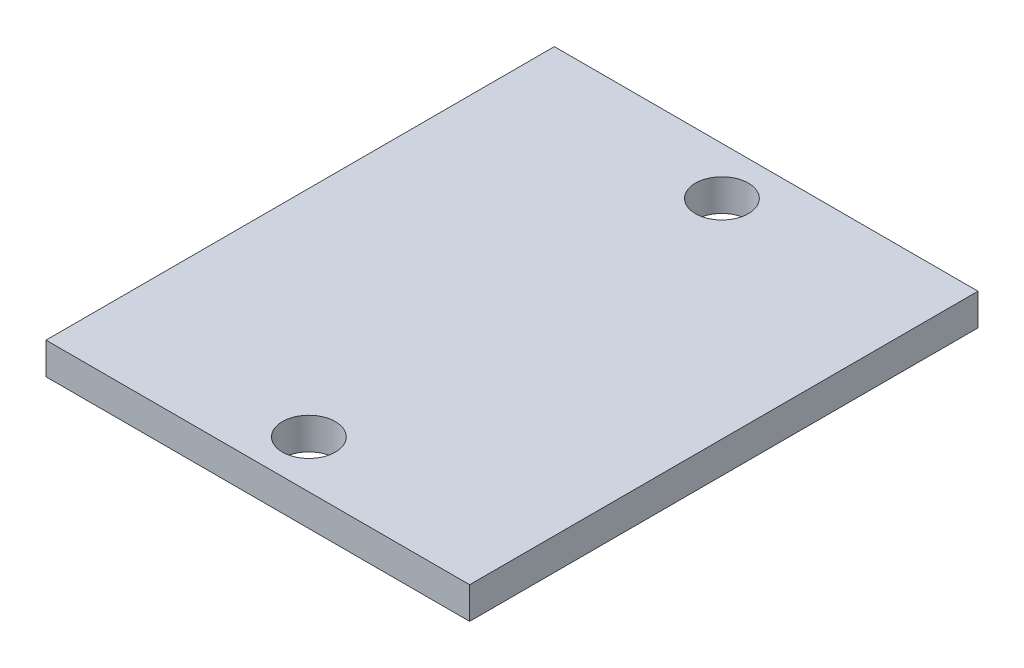
ISO-10303-21;
HEADER;
FILE_DESCRIPTION(('STEP AP214'),'2;1');
FILE_NAME('part.step','',(''),(''),'','','');
FILE_SCHEMA(('AUTOMOTIVE_DESIGN { 1 0 10303 214 1 1 1 1 }'));
ENDSEC;
DATA;
#1=APPLICATION_CONTEXT('core data for automotive mechanical design processes');
#2=APPLICATION_PROTOCOL_DEFINITION('international standard','automotive_design',2000,#1);
#3=PRODUCT_CONTEXT('',#1,'mechanical');
#4=PRODUCT('Part','Part','',(#3));
#5=PRODUCT_RELATED_PRODUCT_CATEGORY('part','',(#4));
#6=PRODUCT_DEFINITION_FORMATION('','',#4);
#7=PRODUCT_DEFINITION_CONTEXT('part definition',#1,'design');
#8=PRODUCT_DEFINITION('design','',#6,#7);
#9=PRODUCT_DEFINITION_SHAPE('','',#8);
#10=(LENGTH_UNIT() NAMED_UNIT(*) SI_UNIT(.MILLI.,.METRE.));
#11=(NAMED_UNIT(*) PLANE_ANGLE_UNIT() SI_UNIT($,.RADIAN.));
#12=(NAMED_UNIT(*) SI_UNIT($,.STERADIAN.) SOLID_ANGLE_UNIT());
#13=UNCERTAINTY_MEASURE_WITH_UNIT(LENGTH_MEASURE(1.E-05),#10,'distance_accuracy_value','');
#14=(GEOMETRIC_REPRESENTATION_CONTEXT(3) GLOBAL_UNCERTAINTY_ASSIGNED_CONTEXT((#13)) GLOBAL_UNIT_ASSIGNED_CONTEXT((#10,
#11,#12)) REPRESENTATION_CONTEXT('',''));
#15=CARTESIAN_POINT('',(0.,0.,0.));
#16=DIRECTION('',(0.,0.,1.));
#17=DIRECTION('',(1.,0.,0.));
#18=AXIS2_PLACEMENT_3D('',#15,#16,#17);
#19=CARTESIAN_POINT('',(20.,1.5,0.));
#20=DIRECTION('',(1.,0.,0.));
#21=DIRECTION('',(0.,0.,-1.));
#22=AXIS2_PLACEMENT_3D('',#19,#20,#21);
#23=PLANE('',#22);
#24=DIRECTION('',(0.,0.,1.));
#25=VECTOR('',#24,1.);
#26=CARTESIAN_POINT('',(20.,0.,0.));
#27=LINE('',#26,#25);
#28=CARTESIAN_POINT('',(20.,0.,0.));
#29=VERTEX_POINT('',#28);
#30=CARTESIAN_POINT('',(20.,0.,24.));
#31=VERTEX_POINT('',#30);
#32=EDGE_CURVE('E109',#29,#31,#27,.T.);
#33=ORIENTED_EDGE('',*,*,#32,.F.);
#34=DIRECTION('',(0.,-1.,0.));
#35=VECTOR('',#34,1.);
#36=CARTESIAN_POINT('',(20.,1.5,0.));
#37=LINE('',#36,#35);
#38=CARTESIAN_POINT('',(20.,1.5,0.));
#39=VERTEX_POINT('',#38);
#40=EDGE_CURVE('E11',#39,#29,#37,.T.);
#41=ORIENTED_EDGE('',*,*,#40,.F.);
#42=DIRECTION('',(0.,0.,1.));
#43=VECTOR('',#42,1.);
#44=CARTESIAN_POINT('',(20.,1.5,0.));
#45=LINE('',#44,#43);
#46=CARTESIAN_POINT('',(20.,1.5,24.));
#47=VERTEX_POINT('',#46);
#48=EDGE_CURVE('E96',#39,#47,#45,.T.);
#49=ORIENTED_EDGE('',*,*,#48,.T.);
#50=DIRECTION('',(0.,-1.,0.));
#51=VECTOR('',#50,1.);
#52=CARTESIAN_POINT('',(20.,1.5,24.));
#53=LINE('',#52,#51);
#54=EDGE_CURVE('E74',#47,#31,#53,.T.);
#55=ORIENTED_EDGE('',*,*,#54,.T.);
#56=EDGE_LOOP('',(#33,#41,#49,#55));
#57=FACE_BOUND('',#56,.T.);
#58=ADVANCED_FACE('F34',(#57),#23,.T.);
#59=CARTESIAN_POINT('',(0.,1.5,0.));
#60=DIRECTION('',(0.,0.,-1.));
#61=DIRECTION('',(-1.,0.,0.));
#62=AXIS2_PLACEMENT_3D('',#59,#60,#61);
#63=PLANE('',#62);
#64=DIRECTION('',(1.,0.,0.));
#65=VECTOR('',#64,1.);
#66=CARTESIAN_POINT('',(0.,0.,0.));
#67=LINE('',#66,#65);
#68=CARTESIAN_POINT('',(0.,0.,0.));
#69=VERTEX_POINT('',#68);
#70=EDGE_CURVE('E86',#69,#29,#67,.T.);
#71=ORIENTED_EDGE('',*,*,#70,.F.);
#72=DIRECTION('',(0.,-1.,0.));
#73=VECTOR('',#72,1.);
#74=CARTESIAN_POINT('',(0.,1.5,0.));
#75=LINE('',#74,#73);
#76=CARTESIAN_POINT('',(0.,1.5,0.));
#77=VERTEX_POINT('',#76);
#78=EDGE_CURVE('E43',#77,#69,#75,.T.);
#79=ORIENTED_EDGE('',*,*,#78,.F.);
#80=DIRECTION('',(1.,0.,0.));
#81=VECTOR('',#80,1.);
#82=CARTESIAN_POINT('',(0.,1.5,0.));
#83=LINE('',#82,#81);
#84=EDGE_CURVE('E84',#77,#39,#83,.T.);
#85=ORIENTED_EDGE('',*,*,#84,.T.);
#86=ORIENTED_EDGE('',*,*,#40,.T.);
#87=EDGE_LOOP('',(#71,#79,#85,#86));
#88=FACE_BOUND('',#87,.T.);
#89=ADVANCED_FACE('F82',(#88),#63,.T.);
#90=CARTESIAN_POINT('',(0.,1.5,0.));
#91=DIRECTION('',(1.,0.,0.));
#92=DIRECTION('',(0.,0.,-1.));
#93=AXIS2_PLACEMENT_3D('',#90,#91,#92);
#94=PLANE('',#93);
#95=DIRECTION('',(0.,0.,1.));
#96=VECTOR('',#95,1.);
#97=CARTESIAN_POINT('',(0.,0.,0.));
#98=LINE('',#97,#96);
#99=CARTESIAN_POINT('',(0.,0.,24.));
#100=VERTEX_POINT('',#99);
#101=EDGE_CURVE('E112',#69,#100,#98,.T.);
#102=ORIENTED_EDGE('',*,*,#101,.T.);
#103=DIRECTION('',(0.,-1.,0.));
#104=VECTOR('',#103,1.);
#105=CARTESIAN_POINT('',(0.,1.5,24.));
#106=LINE('',#105,#104);
#107=CARTESIAN_POINT('',(0.,1.5,24.));
#108=VERTEX_POINT('',#107);
#109=EDGE_CURVE('E89',#108,#100,#106,.T.);
#110=ORIENTED_EDGE('',*,*,#109,.F.);
#111=DIRECTION('',(0.,0.,1.));
#112=VECTOR('',#111,1.);
#113=CARTESIAN_POINT('',(0.,1.5,0.));
#114=LINE('',#113,#112);
#115=EDGE_CURVE('E91',#77,#108,#114,.T.);
#116=ORIENTED_EDGE('',*,*,#115,.F.);
#117=ORIENTED_EDGE('',*,*,#78,.T.);
#118=EDGE_LOOP('',(#102,#110,#116,#117));
#119=FACE_BOUND('',#118,.T.);
#120=ADVANCED_FACE('F92',(#119),#94,.F.);
#121=CARTESIAN_POINT('',(0.,1.5,24.));
#122=DIRECTION('',(0.,0.,-1.));
#123=DIRECTION('',(-1.,0.,0.));
#124=AXIS2_PLACEMENT_3D('',#121,#122,#123);
#125=PLANE('',#124);
#126=DIRECTION('',(1.,0.,0.));
#127=VECTOR('',#126,1.);
#128=CARTESIAN_POINT('',(0.,0.,24.));
#129=LINE('',#128,#127);
#130=EDGE_CURVE('E67',#100,#31,#129,.T.);
#131=ORIENTED_EDGE('',*,*,#130,.T.);
#132=ORIENTED_EDGE('',*,*,#54,.F.);
#133=DIRECTION('',(1.,0.,0.));
#134=VECTOR('',#133,1.);
#135=CARTESIAN_POINT('',(0.,1.5,24.));
#136=LINE('',#135,#134);
#137=EDGE_CURVE('E51',#108,#47,#136,.T.);
#138=ORIENTED_EDGE('',*,*,#137,.F.);
#139=ORIENTED_EDGE('',*,*,#109,.T.);
#140=EDGE_LOOP('',(#131,#132,#138,#139));
#141=FACE_BOUND('',#140,.T.);
#142=ADVANCED_FACE('F120',(#141),#125,.F.);
#143=CARTESIAN_POINT('',(10.16,1.5,21.75));
#144=DIRECTION('',(0.,-1.,0.));
#145=DIRECTION('',(0.,0.,-1.));
#146=AXIS2_PLACEMENT_3D('',#143,#144,#145);
#147=CYLINDRICAL_SURFACE('',#146,1.25);
#148=CARTESIAN_POINT('',(10.16,1.5,21.75));
#149=DIRECTION('',(0.,1.,0.));
#150=DIRECTION('',(0.,0.,1.));
#151=AXIS2_PLACEMENT_3D('',#148,#149,#150);
#152=CIRCLE('',#151,1.25);
#153=CARTESIAN_POINT('',(10.16,1.5,23.));
#154=VERTEX_POINT('',#153);
#155=EDGE_CURVE('E98',#154,#154,#152,.T.);
#156=ORIENTED_EDGE('',*,*,#155,.T.);
#157=EDGE_LOOP('',(#156));
#158=FACE_BOUND('',#157,.T.);
#159=CARTESIAN_POINT('',(10.16,0.,21.75));
#160=DIRECTION('',(0.,1.,0.));
#161=DIRECTION('',(0.,0.,1.));
#162=AXIS2_PLACEMENT_3D('',#159,#160,#161);
#163=CIRCLE('',#162,1.25);
#164=CARTESIAN_POINT('',(10.16,0.,23.));
#165=VERTEX_POINT('',#164);
#166=EDGE_CURVE('E106',#165,#165,#163,.T.);
#167=ORIENTED_EDGE('',*,*,#166,.F.);
#168=EDGE_LOOP('',(#167));
#169=FACE_BOUND('',#168,.T.);
#170=ADVANCED_FACE('F36',(#158,#169),#147,.F.);
#171=CARTESIAN_POINT('',(10.16,1.5,2.25));
#172=DIRECTION('',(0.,-1.,0.));
#173=DIRECTION('',(0.,0.,-1.));
#174=AXIS2_PLACEMENT_3D('',#171,#172,#173);
#175=CYLINDRICAL_SURFACE('',#174,1.25);
#176=CARTESIAN_POINT('',(10.16,1.5,2.25));
#177=DIRECTION('',(0.,1.,0.));
#178=DIRECTION('',(0.,0.,1.));
#179=AXIS2_PLACEMENT_3D('',#176,#177,#178);
#180=CIRCLE('',#179,1.25);
#181=CARTESIAN_POINT('',(10.16,1.5,3.5));
#182=VERTEX_POINT('',#181);
#183=EDGE_CURVE('E103',#182,#182,#180,.T.);
#184=ORIENTED_EDGE('',*,*,#183,.T.);
#185=EDGE_LOOP('',(#184));
#186=FACE_BOUND('',#185,.T.);
#187=CARTESIAN_POINT('',(10.16,0.,2.25));
#188=DIRECTION('',(0.,1.,0.));
#189=DIRECTION('',(0.,0.,1.));
#190=AXIS2_PLACEMENT_3D('',#187,#188,#189);
#191=CIRCLE('',#190,1.25);
#192=CARTESIAN_POINT('',(10.16,0.,3.5));
#193=VERTEX_POINT('',#192);
#194=EDGE_CURVE('E115',#193,#193,#191,.T.);
#195=ORIENTED_EDGE('',*,*,#194,.F.);
#196=EDGE_LOOP('',(#195));
#197=FACE_BOUND('',#196,.T.);
#198=ADVANCED_FACE('F133',(#186,#197),#175,.F.);
#199=CARTESIAN_POINT('',(0.,1.5,0.));
#200=DIRECTION('',(0.,1.,0.));
#201=DIRECTION('',(0.,0.,1.));
#202=AXIS2_PLACEMENT_3D('',#199,#200,#201);
#203=PLANE('',#202);
#204=ORIENTED_EDGE('',*,*,#155,.F.);
#205=EDGE_LOOP('',(#204));
#206=FACE_BOUND('',#205,.T.);
#207=ORIENTED_EDGE('',*,*,#48,.F.);
#208=ORIENTED_EDGE('',*,*,#84,.F.);
#209=ORIENTED_EDGE('',*,*,#115,.T.);
#210=ORIENTED_EDGE('',*,*,#137,.T.);
#211=EDGE_LOOP('',(#207,#208,#209,#210));
#212=FACE_BOUND('',#211,.T.);
#213=ORIENTED_EDGE('',*,*,#183,.F.);
#214=EDGE_LOOP('',(#213));
#215=FACE_BOUND('',#214,.T.);
#216=ADVANCED_FACE('F94',(#206,#212,#215),#203,.T.);
#217=CARTESIAN_POINT('',(0.,0.,0.));
#218=DIRECTION('',(0.,1.,0.));
#219=DIRECTION('',(0.,0.,1.));
#220=AXIS2_PLACEMENT_3D('',#217,#218,#219);
#221=PLANE('',#220);
#222=ORIENTED_EDGE('',*,*,#166,.T.);
#223=EDGE_LOOP('',(#222));
#224=FACE_BOUND('',#223,.T.);
#225=ORIENTED_EDGE('',*,*,#32,.T.);
#226=ORIENTED_EDGE('',*,*,#130,.F.);
#227=ORIENTED_EDGE('',*,*,#101,.F.);
#228=ORIENTED_EDGE('',*,*,#70,.T.);
#229=EDGE_LOOP('',(#225,#226,#227,#228));
#230=FACE_BOUND('',#229,.T.);
#231=ORIENTED_EDGE('',*,*,#194,.T.);
#232=EDGE_LOOP('',(#231));
#233=FACE_BOUND('',#232,.T.);
#234=ADVANCED_FACE('F121',(#224,#230,#233),#221,.F.);
#235=CLOSED_SHELL('',(#58,#89,#120,#142,#170,#198,#216,#234));
#236=MANIFOLD_SOLID_BREP('B2',#235);
#237=ADVANCED_BREP_SHAPE_REPRESENTATION('',(#18,#236),#14);
#238=SHAPE_DEFINITION_REPRESENTATION(#9,#237);
ENDSEC;
END-ISO-10303-21;
